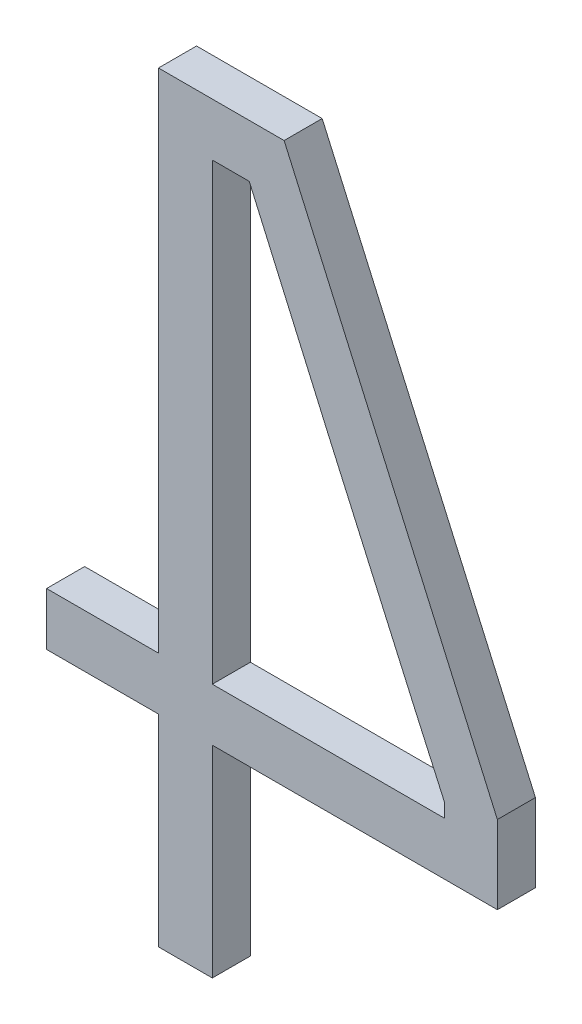
ISO-10303-21;
HEADER;
FILE_DESCRIPTION(('STEP AP214'),'2;1');
FILE_NAME('part.step','',(''),(''),'','','');
FILE_SCHEMA(('AUTOMOTIVE_DESIGN { 1 0 10303 214 1 1 1 1 }'));
ENDSEC;
DATA;
#1=APPLICATION_CONTEXT('core data for automotive mechanical design processes');
#2=APPLICATION_PROTOCOL_DEFINITION('international standard','automotive_design',2000,#1);
#3=PRODUCT_CONTEXT('',#1,'mechanical');
#4=PRODUCT('Part','Part','',(#3));
#5=PRODUCT_RELATED_PRODUCT_CATEGORY('part','',(#4));
#6=PRODUCT_DEFINITION_FORMATION('','',#4);
#7=PRODUCT_DEFINITION_CONTEXT('part definition',#1,'design');
#8=PRODUCT_DEFINITION('design','',#6,#7);
#9=PRODUCT_DEFINITION_SHAPE('','',#8);
#10=(LENGTH_UNIT() NAMED_UNIT(*) SI_UNIT(.MILLI.,.METRE.));
#11=(NAMED_UNIT(*) PLANE_ANGLE_UNIT() SI_UNIT($,.RADIAN.));
#12=(NAMED_UNIT(*) SI_UNIT($,.STERADIAN.) SOLID_ANGLE_UNIT());
#13=UNCERTAINTY_MEASURE_WITH_UNIT(LENGTH_MEASURE(1.E-05),#10,'distance_accuracy_value','');
#14=(GEOMETRIC_REPRESENTATION_CONTEXT(3) GLOBAL_UNCERTAINTY_ASSIGNED_CONTEXT((#13)) GLOBAL_UNIT_ASSIGNED_CONTEXT((#10,
#11,#12)) REPRESENTATION_CONTEXT('',''));
#15=CARTESIAN_POINT('',(0.,0.,0.));
#16=DIRECTION('',(0.,0.,1.));
#17=DIRECTION('',(1.,0.,0.));
#18=AXIS2_PLACEMENT_3D('',#15,#16,#17);
#19=CARTESIAN_POINT('',(149.468215572147,67.0614774798734,-39.1));
#20=DIRECTION('',(0.,0.,-1.));
#21=DIRECTION('',(-1.,0.,0.));
#22=AXIS2_PLACEMENT_3D('',#19,#20,#21);
#23=PLANE('',#22);
#24=CARTESIAN_POINT('',(149.72624523879,66.4837541985711,-39.1));
#25=CARTESIAN_POINT('',(149.722721283123,66.4913071153698,-39.1));
#26=CARTESIAN_POINT('',(149.719250866114,66.4988844232125,-39.1));
#27=CARTESIAN_POINT('',(149.712360608184,66.5140620354187,-39.1));
#28=CARTESIAN_POINT('',(149.708940767045,66.5216623396828,-39.1));
#29=CARTESIAN_POINT('',(149.698672352682,66.5444590765013,-39.1));
#30=CARTESIAN_POINT('',(149.691814847678,66.5596514241189,-39.1));
#31=CARTESIAN_POINT('',(149.671293303482,66.6052512352428,-39.1));
#32=CARTESIAN_POINT('',(149.657680150167,66.6356816535203,-39.1));
#33=CARTESIAN_POINT('',(149.616966795035,66.7270219666411,-39.1));
#34=CARTESIAN_POINT('',(149.589990073684,66.787986722929,-39.1));
#35=CARTESIAN_POINT('',(149.535855445363,66.9098359259749,-39.1));
#36=CARTESIAN_POINT('',(149.508697537731,66.970720372439,-39.1));
#37=CARTESIAN_POINT('',(149.458954339243,67.0822500247213,-39.1));
#38=CARTESIAN_POINT('',(149.436368305255,67.1328948842609,-39.1));
#39=CARTESIAN_POINT('',(149.39142477384,67.2342858186132,-39.1));
#40=CARTESIAN_POINT('',(149.369067275823,67.2850318931645,-39.1));
#41=CARTESIAN_POINT('',(149.335588678238,67.3611765957922,-39.1));
#42=CARTESIAN_POINT('',(149.324438679418,67.3865625986879,-39.1));
#43=CARTESIAN_POINT('',(149.302129344822,67.437330496617,-39.1));
#44=CARTESIAN_POINT('',(149.290970009053,67.4627123916533,-39.1));
#45=CARTESIAN_POINT('',(149.268660682185,67.5134804821219,-39.1));
#46=CARTESIAN_POINT('',(149.257510691152,67.538866677583,-39.1));
#47=CARTESIAN_POINT('',(149.240790345326,67.5769480640356,-39.1));
#48=CARTESIAN_POINT('',(149.235217667062,67.5896422154851,-39.1));
#49=CARTESIAN_POINT('',(149.224108037119,67.6150461462315,-39.1));
#50=CARTESIAN_POINT('',(149.218571085494,67.6277559255522,-39.1));
#51=CARTESIAN_POINT('',(149.21306909454,67.6404809669511,-39.1));
#52=B_SPLINE_CURVE_WITH_KNOTS('',3,(#24,#25,#26,#27,#28,#29,#30,#31,#32,#33,#34,#35,#36,#37,#38,
#39,#40,#41,#42,#43,#44,#45,#46,#47,#48,#49,#50,#51),.UNSPECIFIED.,.F.,.F.,(4,2,2,2,2,2,2,2,2,2,
2,2,2,4),(0.,0.0250027689025611,0.0500054297778136,0.100010452205787,0.20001988227599,
0.400019635917184,0.600020119441669,0.766378762977204,0.932736977275151,1.01591719935899,
1.09909736267171,1.18227810555436,1.2238685234399,1.26545900455956),.UNSPECIFIED.);
#53=CARTESIAN_POINT('',(149.72624523879,66.4837541985711,-39.1));
#54=VERTEX_POINT('',#53);
#55=CARTESIAN_POINT('',(149.21306909454,67.6404809669511,-39.1));
#56=VERTEX_POINT('',#55);
#57=EDGE_CURVE('E24',#54,#56,#52,.T.);
#58=ORIENTED_EDGE('',*,*,#57,.T.);
#59=DIRECTION('',(1.,0.,0.));
#60=VECTOR('',#59,1.);
#61=CARTESIAN_POINT('',(149.1159817159,67.6404809669511,-39.1));
#62=LINE('',#61,#60);
#63=CARTESIAN_POINT('',(149.1159817159,67.6404809669511,-39.1));
#64=VERTEX_POINT('',#63);
#65=EDGE_CURVE('E80',#56,#64,#62,.F.);
#66=ORIENTED_EDGE('',*,*,#65,.T.);
#67=DIRECTION('',(0.,1.,0.));
#68=VECTOR('',#67,1.);
#69=CARTESIAN_POINT('',(149.1159817159,66.4476931722211,-39.1));
#70=LINE('',#69,#68);
#71=CARTESIAN_POINT('',(149.1159817159,66.4476931722211,-39.1));
#72=VERTEX_POINT('',#71);
#73=EDGE_CURVE('E103',#64,#72,#70,.F.);
#74=ORIENTED_EDGE('',*,*,#73,.T.);
#75=DIRECTION('',(1.,0.,0.));
#76=VECTOR('',#75,1.);
#77=CARTESIAN_POINT('',(149.72624523879,66.4476931722211,-39.1));
#78=LINE('',#77,#76);
#79=CARTESIAN_POINT('',(149.72624523879,66.4476931722211,-39.1));
#80=VERTEX_POINT('',#79);
#81=EDGE_CURVE('E110',#72,#80,#78,.T.);
#82=ORIENTED_EDGE('',*,*,#81,.T.);
#83=DIRECTION('',(0.,1.,0.));
#84=VECTOR('',#83,1.);
#85=CARTESIAN_POINT('',(149.72624523879,66.4837541985711,-39.1));
#86=LINE('',#85,#84);
#87=EDGE_CURVE('E75',#80,#54,#86,.T.);
#88=ORIENTED_EDGE('',*,*,#87,.T.);
#89=EDGE_LOOP('',(#58,#66,#74,#82,#88));
#90=FACE_BOUND('',#89,.T.);
#91=DIRECTION('',(0.,1.,0.));
#92=VECTOR('',#91,1.);
#93=CARTESIAN_POINT('',(148.9745115356,66.3089969170211,-39.1));
#94=LINE('',#93,#92);
#95=CARTESIAN_POINT('',(148.9745115356,65.7791772221511,-39.1));
#96=VERTEX_POINT('',#95);
#97=CARTESIAN_POINT('',(148.9745115356,66.3089969170211,-39.1));
#98=VERTEX_POINT('',#97);
#99=EDGE_CURVE('E139',#96,#98,#94,.T.);
#100=ORIENTED_EDGE('',*,*,#99,.T.);
#101=DIRECTION('',(1.,0.,0.));
#102=VECTOR('',#101,1.);
#103=CARTESIAN_POINT('',(148.68047547457,66.3089969170211,-39.1));
#104=LINE('',#103,#102);
#105=CARTESIAN_POINT('',(148.68047547457,66.3089969170211,-39.1));
#106=VERTEX_POINT('',#105);
#107=EDGE_CURVE('E133',#98,#106,#104,.F.);
#108=ORIENTED_EDGE('',*,*,#107,.T.);
#109=DIRECTION('',(0.,1.,0.));
#110=VECTOR('',#109,1.);
#111=CARTESIAN_POINT('',(148.68047547457,66.4476931722211,-39.1));
#112=LINE('',#111,#110);
#113=CARTESIAN_POINT('',(148.68047547457,66.4476931722211,-39.1));
#114=VERTEX_POINT('',#113);
#115=EDGE_CURVE('E124',#106,#114,#112,.T.);
#116=ORIENTED_EDGE('',*,*,#115,.T.);
#117=DIRECTION('',(1.,0.,0.));
#118=VECTOR('',#117,1.);
#119=CARTESIAN_POINT('',(148.9745115356,66.4476931722211,-39.1));
#120=LINE('',#119,#118);
#121=CARTESIAN_POINT('',(148.9745115356,66.4476931722211,-39.1));
#122=VERTEX_POINT('',#121);
#123=EDGE_CURVE('E187',#114,#122,#120,.T.);
#124=ORIENTED_EDGE('',*,*,#123,.T.);
#125=DIRECTION('',(0.,1.,0.));
#126=VECTOR('',#125,1.);
#127=CARTESIAN_POINT('',(148.9745115356,67.7791772221511,-39.1));
#128=LINE('',#127,#126);
#129=CARTESIAN_POINT('',(148.9745115356,67.7791772221511,-39.1));
#130=VERTEX_POINT('',#129);
#131=EDGE_CURVE('E181',#122,#130,#128,.T.);
#132=ORIENTED_EDGE('',*,*,#131,.T.);
#133=DIRECTION('',(1.,0.,0.));
#134=VECTOR('',#133,1.);
#135=CARTESIAN_POINT('',(149.30460862298,67.7791772221511,-39.1));
#136=LINE('',#135,#134);
#137=CARTESIAN_POINT('',(149.30460862298,67.7791772221511,-39.1));
#138=VERTEX_POINT('',#137);
#139=EDGE_CURVE('E175',#130,#138,#136,.T.);
#140=ORIENTED_EDGE('',*,*,#139,.T.);
#141=DIRECTION('',(0.405021944577005,-0.914306963995715,0.));
#142=VECTOR('',#141,1.);
#143=CARTESIAN_POINT('',(149.864941493991,66.5142673747213,-39.1));
#144=LINE('',#143,#142);
#145=CARTESIAN_POINT('',(149.864941493991,66.5142673747212,-39.1));
#146=VERTEX_POINT('',#145);
#147=EDGE_CURVE('E169',#138,#146,#144,.T.);
#148=ORIENTED_EDGE('',*,*,#147,.T.);
#149=DIRECTION('',(0.,1.,0.));
#150=VECTOR('',#149,1.);
#151=CARTESIAN_POINT('',(149.86494149399,66.3089969170211,-39.1));
#152=LINE('',#151,#150);
#153=CARTESIAN_POINT('',(149.86494149399,66.3089969170211,-39.1));
#154=VERTEX_POINT('',#153);
#155=EDGE_CURVE('E163',#146,#154,#152,.F.);
#156=ORIENTED_EDGE('',*,*,#155,.T.);
#157=DIRECTION('',(1.,0.,0.));
#158=VECTOR('',#157,1.);
#159=CARTESIAN_POINT('',(149.1159817159,66.3089969170211,-39.1));
#160=LINE('',#159,#158);
#161=CARTESIAN_POINT('',(149.1159817159,66.3089969170211,-39.1));
#162=VERTEX_POINT('',#161);
#163=EDGE_CURVE('E157',#154,#162,#160,.F.);
#164=ORIENTED_EDGE('',*,*,#163,.T.);
#165=DIRECTION('',(0.,1.,0.));
#166=VECTOR('',#165,1.);
#167=CARTESIAN_POINT('',(149.1159817159,65.7791772221511,-39.1));
#168=LINE('',#167,#166);
#169=CARTESIAN_POINT('',(149.1159817159,65.7791772221511,-39.1));
#170=VERTEX_POINT('',#169);
#171=EDGE_CURVE('E151',#162,#170,#168,.F.);
#172=ORIENTED_EDGE('',*,*,#171,.T.);
#173=DIRECTION('',(1.,0.,0.));
#174=VECTOR('',#173,1.);
#175=CARTESIAN_POINT('',(148.9745115356,65.7791772221511,-39.1));
#176=LINE('',#175,#174);
#177=EDGE_CURVE('E145',#170,#96,#176,.F.);
#178=ORIENTED_EDGE('',*,*,#177,.T.);
#179=EDGE_LOOP('',(#100,#108,#116,#124,#132,#140,#148,#156,#164,#172,#178));
#180=FACE_BOUND('',#179,.T.);
#181=ADVANCED_FACE('F17',(#90,#180),#23,.T.);
#182=CARTESIAN_POINT('',(148.9745115356,66.4476931722211,-39.));
#183=DIRECTION('',(0.,-1.,0.));
#184=DIRECTION('',(0.,0.,-1.));
#185=AXIS2_PLACEMENT_3D('',#182,#183,#184);
#186=PLANE('',#185);
#187=DIRECTION('',(0.,0.,-1.));
#188=VECTOR('',#187,1.);
#189=CARTESIAN_POINT('',(148.68047547457,66.4476931722211,-39.));
#190=LINE('',#189,#188);
#191=CARTESIAN_POINT('',(148.68047547457,66.4476931722211,-39.));
#192=VERTEX_POINT('',#191);
#193=EDGE_CURVE('E130',#114,#192,#190,.F.);
#194=ORIENTED_EDGE('',*,*,#193,.T.);
#195=DIRECTION('',(-1.,0.,0.));
#196=VECTOR('',#195,1.);
#197=CARTESIAN_POINT('',(149.468215572147,66.4476931722211,-39.));
#198=LINE('',#197,#196);
#199=CARTESIAN_POINT('',(148.9745115356,66.4476931722211,-39.));
#200=VERTEX_POINT('',#199);
#201=EDGE_CURVE('E97',#192,#200,#198,.F.);
#202=ORIENTED_EDGE('',*,*,#201,.T.);
#203=DIRECTION('',(0.,0.,-1.));
#204=VECTOR('',#203,1.);
#205=CARTESIAN_POINT('',(148.9745115356,66.4476931722211,-39.));
#206=LINE('',#205,#204);
#207=EDGE_CURVE('E184',#200,#122,#206,.T.);
#208=ORIENTED_EDGE('',*,*,#207,.T.);
#209=ORIENTED_EDGE('',*,*,#123,.F.);
#210=EDGE_LOOP('',(#194,#202,#208,#209));
#211=FACE_BOUND('',#210,.T.);
#212=ADVANCED_FACE('F262',(#211),#186,.F.);
#213=CARTESIAN_POINT('',(148.9745115356,67.7791772221511,-39.));
#214=DIRECTION('',(1.,0.,0.));
#215=DIRECTION('',(0.,0.,-1.));
#216=AXIS2_PLACEMENT_3D('',#213,#214,#215);
#217=PLANE('',#216);
#218=ORIENTED_EDGE('',*,*,#207,.F.);
#219=DIRECTION('',(0.,1.,0.));
#220=VECTOR('',#219,1.);
#221=CARTESIAN_POINT('',(148.9745115356,67.0614774798734,-39.));
#222=LINE('',#221,#220);
#223=CARTESIAN_POINT('',(148.9745115356,67.7791772221511,-39.));
#224=VERTEX_POINT('',#223);
#225=EDGE_CURVE('E465',#200,#224,#222,.T.);
#226=ORIENTED_EDGE('',*,*,#225,.T.);
#227=DIRECTION('',(0.,0.,-1.));
#228=VECTOR('',#227,1.);
#229=CARTESIAN_POINT('',(148.9745115356,67.7791772221511,-39.));
#230=LINE('',#229,#228);
#231=EDGE_CURVE('E178',#224,#130,#230,.T.);
#232=ORIENTED_EDGE('',*,*,#231,.T.);
#233=ORIENTED_EDGE('',*,*,#131,.F.);
#234=EDGE_LOOP('',(#218,#226,#232,#233));
#235=FACE_BOUND('',#234,.T.);
#236=ADVANCED_FACE('F258',(#235),#217,.F.);
#237=CARTESIAN_POINT('',(149.30460862298,67.7791772221511,-39.));
#238=DIRECTION('',(0.,-1.,0.));
#239=DIRECTION('',(0.,0.,-1.));
#240=AXIS2_PLACEMENT_3D('',#237,#238,#239);
#241=PLANE('',#240);
#242=ORIENTED_EDGE('',*,*,#231,.F.);
#243=DIRECTION('',(-1.,0.,0.));
#244=VECTOR('',#243,1.);
#245=CARTESIAN_POINT('',(149.468215572147,67.7791772221511,-39.));
#246=LINE('',#245,#244);
#247=CARTESIAN_POINT('',(149.30460862298,67.7791772221511,-39.));
#248=VERTEX_POINT('',#247);
#249=EDGE_CURVE('E463',#224,#248,#246,.F.);
#250=ORIENTED_EDGE('',*,*,#249,.T.);
#251=DIRECTION('',(0.,0.,1.));
#252=VECTOR('',#251,1.);
#253=CARTESIAN_POINT('',(149.30460862298,67.7791772221511,-39.));
#254=LINE('',#253,#252);
#255=EDGE_CURVE('E172',#248,#138,#254,.F.);
#256=ORIENTED_EDGE('',*,*,#255,.T.);
#257=ORIENTED_EDGE('',*,*,#139,.F.);
#258=EDGE_LOOP('',(#242,#250,#256,#257));
#259=FACE_BOUND('',#258,.T.);
#260=ADVANCED_FACE('F254',(#259),#241,.F.);
#261=CARTESIAN_POINT('',(149.864941493991,66.5142673747213,-39.));
#262=DIRECTION('',(-0.914306963995715,-0.405021944577005,0.));
#263=DIRECTION('',(0.405021944577005,-0.914306963995715,0.));
#264=AXIS2_PLACEMENT_3D('',#261,#262,#263);
#265=PLANE('',#264);
#266=ORIENTED_EDGE('',*,*,#255,.F.);
#267=DIRECTION('',(0.405021944576632,-0.91430696399588,0.));
#268=VECTOR('',#267,1.);
#269=CARTESIAN_POINT('',(149.30460862298,67.7791772221511,-39.));
#270=LINE('',#269,#268);
#271=CARTESIAN_POINT('',(149.864941493991,66.5142673747212,-39.));
#272=VERTEX_POINT('',#271);
#273=EDGE_CURVE('E460',#248,#272,#270,.T.);
#274=ORIENTED_EDGE('',*,*,#273,.T.);
#275=DIRECTION('',(0.,0.,1.));
#276=VECTOR('',#275,1.);
#277=CARTESIAN_POINT('',(149.86494149399,66.5142673747211,-39.));
#278=LINE('',#277,#276);
#279=EDGE_CURVE('E166',#272,#146,#278,.F.);
#280=ORIENTED_EDGE('',*,*,#279,.T.);
#281=ORIENTED_EDGE('',*,*,#147,.F.);
#282=EDGE_LOOP('',(#266,#274,#280,#281));
#283=FACE_BOUND('',#282,.T.);
#284=ADVANCED_FACE('F250',(#283),#265,.F.);
#285=CARTESIAN_POINT('',(149.86494149399,66.3089969170211,-39.));
#286=DIRECTION('',(-1.,0.,0.));
#287=DIRECTION('',(0.,0.,1.));
#288=AXIS2_PLACEMENT_3D('',#285,#286,#287);
#289=PLANE('',#288);
#290=ORIENTED_EDGE('',*,*,#279,.F.);
#291=DIRECTION('',(0.,1.,0.));
#292=VECTOR('',#291,1.);
#293=CARTESIAN_POINT('',(149.86494149399,67.0614774798734,-39.));
#294=LINE('',#293,#292);
#295=CARTESIAN_POINT('',(149.86494149399,66.3089969170211,-39.));
#296=VERTEX_POINT('',#295);
#297=EDGE_CURVE('E457',#272,#296,#294,.F.);
#298=ORIENTED_EDGE('',*,*,#297,.T.);
#299=DIRECTION('',(0.,0.,1.));
#300=VECTOR('',#299,1.);
#301=CARTESIAN_POINT('',(149.86494149399,66.3089969170211,-39.));
#302=LINE('',#301,#300);
#303=EDGE_CURVE('E160',#296,#154,#302,.F.);
#304=ORIENTED_EDGE('',*,*,#303,.T.);
#305=ORIENTED_EDGE('',*,*,#155,.F.);
#306=EDGE_LOOP('',(#290,#298,#304,#305));
#307=FACE_BOUND('',#306,.T.);
#308=ADVANCED_FACE('F246',(#307),#289,.F.);
#309=CARTESIAN_POINT('',(149.1159817159,66.3089969170211,-39.));
#310=DIRECTION('',(0.,1.,0.));
#311=DIRECTION('',(0.,0.,1.));
#312=AXIS2_PLACEMENT_3D('',#309,#310,#311);
#313=PLANE('',#312);
#314=ORIENTED_EDGE('',*,*,#303,.F.);
#315=DIRECTION('',(-1.,0.,0.));
#316=VECTOR('',#315,1.);
#317=CARTESIAN_POINT('',(149.468215572147,66.3089969170211,-39.));
#318=LINE('',#317,#316);
#319=CARTESIAN_POINT('',(149.1159817159,66.3089969170211,-39.));
#320=VERTEX_POINT('',#319);
#321=EDGE_CURVE('E454',#296,#320,#318,.T.);
#322=ORIENTED_EDGE('',*,*,#321,.T.);
#323=DIRECTION('',(0.,0.,1.));
#324=VECTOR('',#323,1.);
#325=CARTESIAN_POINT('',(149.1159817159,66.3089969170211,-39.));
#326=LINE('',#325,#324);
#327=EDGE_CURVE('E154',#320,#162,#326,.F.);
#328=ORIENTED_EDGE('',*,*,#327,.T.);
#329=ORIENTED_EDGE('',*,*,#163,.F.);
#330=EDGE_LOOP('',(#314,#322,#328,#329));
#331=FACE_BOUND('',#330,.T.);
#332=ADVANCED_FACE('F242',(#331),#313,.F.);
#333=CARTESIAN_POINT('',(149.1159817159,65.7791772221511,-39.));
#334=DIRECTION('',(-1.,0.,0.));
#335=DIRECTION('',(0.,0.,1.));
#336=AXIS2_PLACEMENT_3D('',#333,#334,#335);
#337=PLANE('',#336);
#338=ORIENTED_EDGE('',*,*,#327,.F.);
#339=DIRECTION('',(0.,1.,0.));
#340=VECTOR('',#339,1.);
#341=CARTESIAN_POINT('',(149.1159817159,67.0614774798734,-39.));
#342=LINE('',#341,#340);
#343=CARTESIAN_POINT('',(149.1159817159,65.7791772221511,-39.));
#344=VERTEX_POINT('',#343);
#345=EDGE_CURVE('E451',#320,#344,#342,.F.);
#346=ORIENTED_EDGE('',*,*,#345,.T.);
#347=DIRECTION('',(0.,0.,1.));
#348=VECTOR('',#347,1.);
#349=CARTESIAN_POINT('',(149.1159817159,65.7791772221511,-39.));
#350=LINE('',#349,#348);
#351=EDGE_CURVE('E148',#344,#170,#350,.F.);
#352=ORIENTED_EDGE('',*,*,#351,.T.);
#353=ORIENTED_EDGE('',*,*,#171,.F.);
#354=EDGE_LOOP('',(#338,#346,#352,#353));
#355=FACE_BOUND('',#354,.T.);
#356=ADVANCED_FACE('F238',(#355),#337,.F.);
#357=CARTESIAN_POINT('',(148.9745115356,65.7791772221511,-39.));
#358=DIRECTION('',(0.,1.,0.));
#359=DIRECTION('',(0.,0.,1.));
#360=AXIS2_PLACEMENT_3D('',#357,#358,#359);
#361=PLANE('',#360);
#362=ORIENTED_EDGE('',*,*,#351,.F.);
#363=DIRECTION('',(-1.,0.,0.));
#364=VECTOR('',#363,1.);
#365=CARTESIAN_POINT('',(149.468215572147,65.7791772221511,-39.));
#366=LINE('',#365,#364);
#367=CARTESIAN_POINT('',(148.9745115356,65.7791772221511,-39.));
#368=VERTEX_POINT('',#367);
#369=EDGE_CURVE('E448',#344,#368,#366,.T.);
#370=ORIENTED_EDGE('',*,*,#369,.T.);
#371=DIRECTION('',(0.,0.,-1.));
#372=VECTOR('',#371,1.);
#373=CARTESIAN_POINT('',(148.9745115356,65.7791772221511,-39.));
#374=LINE('',#373,#372);
#375=EDGE_CURVE('E142',#368,#96,#374,.T.);
#376=ORIENTED_EDGE('',*,*,#375,.T.);
#377=ORIENTED_EDGE('',*,*,#177,.F.);
#378=EDGE_LOOP('',(#362,#370,#376,#377));
#379=FACE_BOUND('',#378,.T.);
#380=ADVANCED_FACE('F234',(#379),#361,.F.);
#381=CARTESIAN_POINT('',(148.9745115356,66.3089969170211,-39.));
#382=DIRECTION('',(1.,0.,0.));
#383=DIRECTION('',(0.,0.,-1.));
#384=AXIS2_PLACEMENT_3D('',#381,#382,#383);
#385=PLANE('',#384);
#386=ORIENTED_EDGE('',*,*,#375,.F.);
#387=DIRECTION('',(0.,1.,0.));
#388=VECTOR('',#387,1.);
#389=CARTESIAN_POINT('',(148.9745115356,67.0614774798734,-39.));
#390=LINE('',#389,#388);
#391=CARTESIAN_POINT('',(148.9745115356,66.3089969170211,-39.));
#392=VERTEX_POINT('',#391);
#393=EDGE_CURVE('E440',#368,#392,#390,.T.);
#394=ORIENTED_EDGE('',*,*,#393,.T.);
#395=DIRECTION('',(0.,0.,1.));
#396=VECTOR('',#395,1.);
#397=CARTESIAN_POINT('',(148.9745115356,66.3089969170211,-39.));
#398=LINE('',#397,#396);
#399=EDGE_CURVE('E136',#392,#98,#398,.F.);
#400=ORIENTED_EDGE('',*,*,#399,.T.);
#401=ORIENTED_EDGE('',*,*,#99,.F.);
#402=EDGE_LOOP('',(#386,#394,#400,#401));
#403=FACE_BOUND('',#402,.T.);
#404=ADVANCED_FACE('F230',(#403),#385,.F.);
#405=CARTESIAN_POINT('',(148.68047547457,66.3089969170211,-39.));
#406=DIRECTION('',(0.,1.,0.));
#407=DIRECTION('',(0.,0.,1.));
#408=AXIS2_PLACEMENT_3D('',#405,#406,#407);
#409=PLANE('',#408);
#410=ORIENTED_EDGE('',*,*,#399,.F.);
#411=DIRECTION('',(-1.,0.,0.));
#412=VECTOR('',#411,1.);
#413=CARTESIAN_POINT('',(149.468215572147,66.3089969170211,-39.));
#414=LINE('',#413,#412);
#415=CARTESIAN_POINT('',(148.68047547457,66.3089969170211,-39.));
#416=VERTEX_POINT('',#415);
#417=EDGE_CURVE('E438',#392,#416,#414,.T.);
#418=ORIENTED_EDGE('',*,*,#417,.T.);
#419=DIRECTION('',(0.,0.,-1.));
#420=VECTOR('',#419,1.);
#421=CARTESIAN_POINT('',(148.68047547457,66.3089969170211,-39.));
#422=LINE('',#421,#420);
#423=EDGE_CURVE('E127',#416,#106,#422,.T.);
#424=ORIENTED_EDGE('',*,*,#423,.T.);
#425=ORIENTED_EDGE('',*,*,#107,.F.);
#426=EDGE_LOOP('',(#410,#418,#424,#425));
#427=FACE_BOUND('',#426,.T.);
#428=ADVANCED_FACE('F226',(#427),#409,.F.);
#429=CARTESIAN_POINT('',(148.68047547457,66.4476931722211,-39.));
#430=DIRECTION('',(1.,0.,0.));
#431=DIRECTION('',(0.,0.,-1.));
#432=AXIS2_PLACEMENT_3D('',#429,#430,#431);
#433=PLANE('',#432);
#434=ORIENTED_EDGE('',*,*,#423,.F.);
#435=DIRECTION('',(0.,1.,0.));
#436=VECTOR('',#435,1.);
#437=CARTESIAN_POINT('',(148.68047547457,67.0614774798734,-39.));
#438=LINE('',#437,#436);
#439=EDGE_CURVE('E117',#416,#192,#438,.T.);
#440=ORIENTED_EDGE('',*,*,#439,.T.);
#441=ORIENTED_EDGE('',*,*,#193,.F.);
#442=ORIENTED_EDGE('',*,*,#115,.F.);
#443=EDGE_LOOP('',(#434,#440,#441,#442));
#444=FACE_BOUND('',#443,.T.);
#445=ADVANCED_FACE('F222',(#444),#433,.F.);
#446=CARTESIAN_POINT('',(149.72624523879,66.4476931722211,-39.));
#447=DIRECTION('',(0.,-1.,0.));
#448=DIRECTION('',(0.,0.,-1.));
#449=AXIS2_PLACEMENT_3D('',#446,#447,#448);
#450=PLANE('',#449);
#451=DIRECTION('',(0.,0.,1.));
#452=VECTOR('',#451,1.);
#453=CARTESIAN_POINT('',(149.1159817159,66.4476931722211,-39.));
#454=LINE('',#453,#452);
#455=CARTESIAN_POINT('',(149.1159817159,66.4476931722211,-39.));
#456=VERTEX_POINT('',#455);
#457=EDGE_CURVE('E90',#72,#456,#454,.T.);
#458=ORIENTED_EDGE('',*,*,#457,.T.);
#459=DIRECTION('',(-1.,0.,0.));
#460=VECTOR('',#459,1.);
#461=CARTESIAN_POINT('',(149.468215572147,66.4476931722211,-39.));
#462=LINE('',#461,#460);
#463=CARTESIAN_POINT('',(149.72624523879,66.4476931722211,-39.));
#464=VERTEX_POINT('',#463);
#465=EDGE_CURVE('E113',#456,#464,#462,.F.);
#466=ORIENTED_EDGE('',*,*,#465,.T.);
#467=DIRECTION('',(0.,0.,-1.));
#468=VECTOR('',#467,1.);
#469=CARTESIAN_POINT('',(149.72624523879,66.4476931722211,-39.));
#470=LINE('',#469,#468);
#471=EDGE_CURVE('E107',#464,#80,#470,.T.);
#472=ORIENTED_EDGE('',*,*,#471,.T.);
#473=ORIENTED_EDGE('',*,*,#81,.F.);
#474=EDGE_LOOP('',(#458,#466,#472,#473));
#475=FACE_BOUND('',#474,.T.);
#476=ADVANCED_FACE('F218',(#475),#450,.F.);
#477=CARTESIAN_POINT('',(149.72624523879,66.4837541985711,-39.));
#478=DIRECTION('',(1.,0.,0.));
#479=DIRECTION('',(0.,0.,-1.));
#480=AXIS2_PLACEMENT_3D('',#477,#478,#479);
#481=PLANE('',#480);
#482=ORIENTED_EDGE('',*,*,#471,.F.);
#483=DIRECTION('',(0.,1.,0.));
#484=VECTOR('',#483,1.);
#485=CARTESIAN_POINT('',(149.72624523879,67.0614774798734,-39.));
#486=LINE('',#485,#484);
#487=CARTESIAN_POINT('',(149.72624523879,66.4837541985711,-39.));
#488=VERTEX_POINT('',#487);
#489=EDGE_CURVE('E116',#464,#488,#486,.T.);
#490=ORIENTED_EDGE('',*,*,#489,.T.);
#491=DIRECTION('',(0.,0.,-1.));
#492=VECTOR('',#491,1.);
#493=CARTESIAN_POINT('',(149.72624523879,66.4837541985711,-39.05));
#494=LINE('',#493,#492);
#495=EDGE_CURVE('E85',#488,#54,#494,.T.);
#496=ORIENTED_EDGE('',*,*,#495,.T.);
#497=ORIENTED_EDGE('',*,*,#87,.F.);
#498=EDGE_LOOP('',(#482,#490,#496,#497));
#499=FACE_BOUND('',#498,.T.);
#500=ADVANCED_FACE('F215',(#499),#481,.F.);
#501=CARTESIAN_POINT('',(149.21306909454,67.6404809669511,-39.));
#502=CARTESIAN_POINT('',(149.21306909454,67.6404809669511,-39.1));
#503=CARTESIAN_POINT('',(149.21608790549,67.6334895797711,-39.));
#504=CARTESIAN_POINT('',(149.21608790549,67.6334895797711,-39.1));
#505=CARTESIAN_POINT('',(149.2244784609,67.6141600432411,-39.));
#506=CARTESIAN_POINT('',(149.2244784609,67.6141600432411,-39.1));
#507=CARTESIAN_POINT('',(149.24068461476,67.5771851504411,-39.));
#508=CARTESIAN_POINT('',(149.24068461476,67.5771851504411,-39.1));
#509=CARTESIAN_POINT('',(149.26334758488,67.5255634021011,-39.));
#510=CARTESIAN_POINT('',(149.26334758488,67.5255634021011,-39.1));
#511=CARTESIAN_POINT('',(149.29125150513,67.4620759647011,-39.));
#512=CARTESIAN_POINT('',(149.29125150513,67.4620759647011,-39.1));
#513=CARTESIAN_POINT('',(149.32315441395,67.3894928127211,-39.));
#514=CARTESIAN_POINT('',(149.32315441395,67.3894928127211,-39.1));
#515=CARTESIAN_POINT('',(149.35813917147,67.3098493793911,-39.));
#516=CARTESIAN_POINT('',(149.35813917147,67.3098493793911,-39.1));
#517=CARTESIAN_POINT('',(149.39574737288,67.2245053970312,-39.));
#518=CARTESIAN_POINT('',(149.39574737288,67.2245053970312,-39.1));
#519=CARTESIAN_POINT('',(149.43551002003,67.1348162633211,-39.));
#520=CARTESIAN_POINT('',(149.43551002003,67.1348162633211,-39.1));
#521=CARTESIAN_POINT('',(149.4765191361,67.0428446317611,-39.));
#522=CARTESIAN_POINT('',(149.4765191361,67.0428446317611,-39.1));
#523=CARTESIAN_POINT('',(149.51737181139,66.9513344024311,-39.));
#524=CARTESIAN_POINT('',(149.51737181139,66.9513344024311,-39.1));
#525=CARTESIAN_POINT('',(149.5566710972,66.8630319456412,-39.));
#526=CARTESIAN_POINT('',(149.5566710972,66.8630319456412,-39.1));
#527=CARTESIAN_POINT('',(149.59350454863,66.7799976956911,-39.));
#528=CARTESIAN_POINT('',(149.59350454863,66.7799976956911,-39.1));
#529=CARTESIAN_POINT('',(149.62740058721,66.7035858191011,-39.));
#530=CARTESIAN_POINT('',(149.62740058721,66.7035858191011,-39.1));
#531=CARTESIAN_POINT('',(149.65791044784,66.6351607488011,-39.));
#532=CARTESIAN_POINT('',(149.65791044784,66.6351607488011,-39.1));
#533=CARTESIAN_POINT('',(149.68406604585,66.5768092504111,-39.));
#534=CARTESIAN_POINT('',(149.68406604585,66.5768092504111,-39.1));
#535=CARTESIAN_POINT('',(149.7045528502,66.5314181619512,-39.));
#536=CARTESIAN_POINT('',(149.7045528502,66.5314181619512,-39.1));
#537=CARTESIAN_POINT('',(149.71788911703,66.5017968398511,-39.));
#538=CARTESIAN_POINT('',(149.71788911703,66.5017968398511,-39.1));
#539=CARTESIAN_POINT('',(149.72432930092,66.4878567131111,-39.));
#540=CARTESIAN_POINT('',(149.72432930092,66.4878567131111,-39.1));
#541=CARTESIAN_POINT('',(149.72624523879,66.4837541985711,-39.));
#542=CARTESIAN_POINT('',(149.72624523879,66.4837541985711,-39.1));
#543=B_SPLINE_SURFACE_WITH_KNOTS('',3,1,((#501,#502),(#503,#504),(#505,#506),(#507,#508),(#509,
#510),(#511,#512),(#513,#514),(#515,#516),(#517,#518),(#519,#520),(#521,#522),(#523,#524),(#525,
#526),(#527,#528),(#529,#530),(#531,#532),(#533,#534),(#535,#536),(#537,#538),(#539,#540),(#541,
#542)),.UNSPECIFIED.,.F.,.F.,.F.,(4,1,1,1,1,1,1,1,1,1,1,1,1,1,1,1,1,1,4),(2,2),(0.,
0.0180533697642,0.0499551744635,0.0957055342945,0.1517063494207,0.2143594892373,0.2836649538748,
0.3579284660078,0.4354559956653,0.5162478394322,0.5966564163633,0.6730339901924,0.7453806294203,
0.8120023466953,0.8712052069021,0.92298941100049,0.96359606205377,0.98926612251555,1.),(1.,1.1),.UNSPECIFIED.);
#544=CARTESIAN_POINT('',(149.72624523879,66.4837541985711,-39.));
#545=CARTESIAN_POINT('',(149.722721283123,66.4913071153698,-39.));
#546=CARTESIAN_POINT('',(149.719250866114,66.4988844232125,-39.));
#547=CARTESIAN_POINT('',(149.712360608184,66.5140620354187,-39.));
#548=CARTESIAN_POINT('',(149.708940767045,66.5216623396828,-39.));
#549=CARTESIAN_POINT('',(149.698672352682,66.5444590765013,-39.));
#550=CARTESIAN_POINT('',(149.691814847678,66.5596514241189,-39.));
#551=CARTESIAN_POINT('',(149.671293303482,66.6052512352428,-39.));
#552=CARTESIAN_POINT('',(149.657680150167,66.6356816535203,-39.));
#553=CARTESIAN_POINT('',(149.616966795035,66.7270219666411,-39.));
#554=CARTESIAN_POINT('',(149.589990073684,66.787986722929,-39.));
#555=CARTESIAN_POINT('',(149.535855445363,66.9098359259749,-39.));
#556=CARTESIAN_POINT('',(149.508697537731,66.970720372439,-39.));
#557=CARTESIAN_POINT('',(149.458954339243,67.0822500247213,-39.));
#558=CARTESIAN_POINT('',(149.436368305255,67.1328948842609,-39.));
#559=CARTESIAN_POINT('',(149.39142477384,67.2342858186133,-39.));
#560=CARTESIAN_POINT('',(149.369067275823,67.2850318931645,-39.));
#561=CARTESIAN_POINT('',(149.335588678238,67.3611765957922,-39.));
#562=CARTESIAN_POINT('',(149.324438679418,67.3865625986879,-39.));
#563=CARTESIAN_POINT('',(149.302129344822,67.437330496617,-39.));
#564=CARTESIAN_POINT('',(149.290970009053,67.4627123916533,-39.));
#565=CARTESIAN_POINT('',(149.268660682185,67.513480482122,-39.));
#566=CARTESIAN_POINT('',(149.257510691152,67.538866677583,-39.));
#567=CARTESIAN_POINT('',(149.240790345326,67.5769480640357,-39.));
#568=CARTESIAN_POINT('',(149.235217667062,67.5896422154851,-39.));
#569=CARTESIAN_POINT('',(149.224108037119,67.6150461462315,-39.));
#570=CARTESIAN_POINT('',(149.218571085494,67.6277559255522,-39.));
#571=CARTESIAN_POINT('',(149.21306909454,67.6404809669511,-39.));
#572=B_SPLINE_CURVE_WITH_KNOTS('',3,(#544,#545,#546,#547,#548,#549,#550,#551,#552,#553,#554,
#555,#556,#557,#558,#559,#560,#561,#562,#563,#564,#565,#566,#567,#568,#569,#570,#571),
.UNSPECIFIED.,.F.,.F.,(4,2,2,2,2,2,2,2,2,2,2,2,2,4),(0.,0.0250027689025495,0.0500054297778135,
0.100010452205775,0.20001988227599,0.400019635917184,0.600020119441669,0.766378762977216,
0.932736977275162,1.01591719935898,1.09909736267171,1.18227810555439,1.22386852343991,
1.26545900455956),.UNSPECIFIED.);
#573=CARTESIAN_POINT('',(149.21306909454,67.6404809669511,-39.));
#574=VERTEX_POINT('',#573);
#575=EDGE_CURVE('E94',#488,#574,#572,.T.);
#576=DIRECTION('',(0.,0.,1.));
#577=VECTOR('',#576,1.);
#578=CARTESIAN_POINT('',(149.21306909454,67.6404809669511,-39.));
#579=LINE('',#578,#577);
#580=EDGE_CURVE('E84',#574,#56,#579,.F.);
#581=ORIENTED_EDGE('',*,*,#495,.F.);
#582=ORIENTED_EDGE('',*,*,#575,.T.);
#583=ORIENTED_EDGE('',*,*,#580,.T.);
#584=ORIENTED_EDGE('',*,*,#57,.F.);
#585=EDGE_LOOP('',(#581,#582,#583,#584));
#586=FACE_BOUND('',#585,.T.);
#587=ADVANCED_FACE('F19',(#586),#543,.F.);
#588=CARTESIAN_POINT('',(149.1159817159,67.6404809669511,-39.));
#589=DIRECTION('',(0.,1.,0.));
#590=DIRECTION('',(0.,0.,1.));
#591=AXIS2_PLACEMENT_3D('',#588,#589,#590);
#592=PLANE('',#591);
#593=ORIENTED_EDGE('',*,*,#580,.F.);
#594=DIRECTION('',(-1.,0.,0.));
#595=VECTOR('',#594,1.);
#596=CARTESIAN_POINT('',(149.468215572147,67.6404809669511,-39.));
#597=LINE('',#596,#595);
#598=CARTESIAN_POINT('',(149.1159817159,67.6404809669511,-39.));
#599=VERTEX_POINT('',#598);
#600=EDGE_CURVE('E34',#574,#599,#597,.T.);
#601=ORIENTED_EDGE('',*,*,#600,.T.);
#602=DIRECTION('',(0.,0.,1.));
#603=VECTOR('',#602,1.);
#604=CARTESIAN_POINT('',(149.1159817159,67.6404809669511,-39.));
#605=LINE('',#604,#603);
#606=EDGE_CURVE('E42',#599,#64,#605,.F.);
#607=ORIENTED_EDGE('',*,*,#606,.T.);
#608=ORIENTED_EDGE('',*,*,#65,.F.);
#609=EDGE_LOOP('',(#593,#601,#607,#608));
#610=FACE_BOUND('',#609,.T.);
#611=ADVANCED_FACE('F87',(#610),#592,.F.);
#612=CARTESIAN_POINT('',(149.1159817159,66.4476931722211,-39.));
#613=DIRECTION('',(-1.,0.,0.));
#614=DIRECTION('',(0.,0.,1.));
#615=AXIS2_PLACEMENT_3D('',#612,#613,#614);
#616=PLANE('',#615);
#617=ORIENTED_EDGE('',*,*,#606,.F.);
#618=DIRECTION('',(0.,1.,0.));
#619=VECTOR('',#618,1.);
#620=CARTESIAN_POINT('',(149.1159817159,67.0614774798734,-39.));
#621=LINE('',#620,#619);
#622=EDGE_CURVE('E11',#599,#456,#621,.F.);
#623=ORIENTED_EDGE('',*,*,#622,.T.);
#624=ORIENTED_EDGE('',*,*,#457,.F.);
#625=ORIENTED_EDGE('',*,*,#73,.F.);
#626=EDGE_LOOP('',(#617,#623,#624,#625));
#627=FACE_BOUND('',#626,.T.);
#628=ADVANCED_FACE('F209',(#627),#616,.F.);
#629=CARTESIAN_POINT('',(149.468215572147,67.0614774798734,-39.));
#630=DIRECTION('',(0.,0.,-1.));
#631=DIRECTION('',(-1.,0.,0.));
#632=AXIS2_PLACEMENT_3D('',#629,#630,#631);
#633=PLANE('',#632);
#634=ORIENTED_EDGE('',*,*,#600,.F.);
#635=ORIENTED_EDGE('',*,*,#575,.F.);
#636=ORIENTED_EDGE('',*,*,#489,.F.);
#637=ORIENTED_EDGE('',*,*,#465,.F.);
#638=ORIENTED_EDGE('',*,*,#622,.F.);
#639=EDGE_LOOP('',(#634,#635,#636,#637,#638));
#640=FACE_BOUND('',#639,.T.);
#641=ORIENTED_EDGE('',*,*,#417,.F.);
#642=ORIENTED_EDGE('',*,*,#393,.F.);
#643=ORIENTED_EDGE('',*,*,#369,.F.);
#644=ORIENTED_EDGE('',*,*,#345,.F.);
#645=ORIENTED_EDGE('',*,*,#321,.F.);
#646=ORIENTED_EDGE('',*,*,#297,.F.);
#647=ORIENTED_EDGE('',*,*,#273,.F.);
#648=ORIENTED_EDGE('',*,*,#249,.F.);
#649=ORIENTED_EDGE('',*,*,#225,.F.);
#650=ORIENTED_EDGE('',*,*,#201,.F.);
#651=ORIENTED_EDGE('',*,*,#439,.F.);
#652=EDGE_LOOP('',(#641,#642,#643,#644,#645,#646,#647,#648,#649,#650,#651));
#653=FACE_BOUND('',#652,.T.);
#654=ADVANCED_FACE('F205',(#640,#653),#633,.F.);
#655=CLOSED_SHELL('',(#181,#212,#236,#260,#284,#308,#332,#356,#380,#404,#428,#445,#476,#500,
#587,#611,#628,#654));
#656=MANIFOLD_SOLID_BREP('B1',#655);
#657=ADVANCED_BREP_SHAPE_REPRESENTATION('',(#18,#656),#14);
#658=SHAPE_DEFINITION_REPRESENTATION(#9,#657);
ENDSEC;
END-ISO-10303-21;
